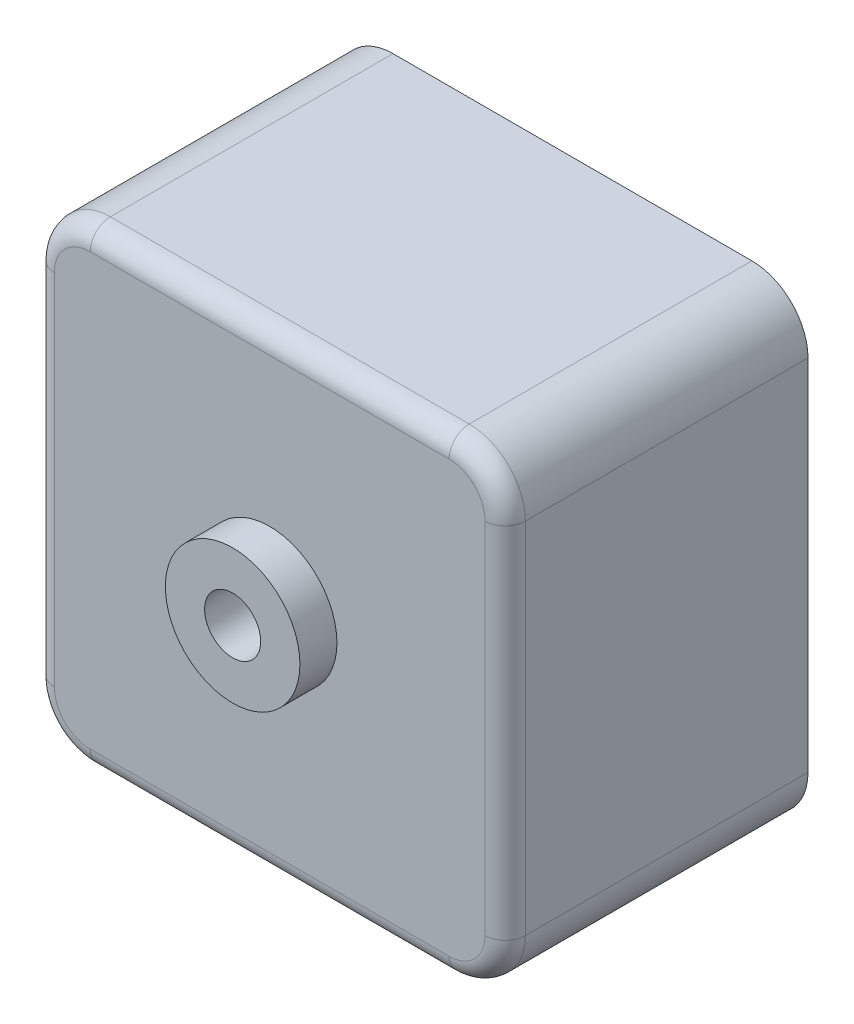
ISO-10303-21;
HEADER;
FILE_DESCRIPTION(('STEP AP214'),'2;1');
FILE_NAME('part.step','',(''),(''),'','','');
FILE_SCHEMA(('AUTOMOTIVE_DESIGN { 1 0 10303 214 1 1 1 1 }'));
ENDSEC;
DATA;
#1=APPLICATION_CONTEXT('core data for automotive mechanical design processes');
#2=APPLICATION_PROTOCOL_DEFINITION('international standard','automotive_design',2000,#1);
#3=PRODUCT_CONTEXT('',#1,'mechanical');
#4=PRODUCT('Part','Part','',(#3));
#5=PRODUCT_RELATED_PRODUCT_CATEGORY('part','',(#4));
#6=PRODUCT_DEFINITION_FORMATION('','',#4);
#7=PRODUCT_DEFINITION_CONTEXT('part definition',#1,'design');
#8=PRODUCT_DEFINITION('design','',#6,#7);
#9=PRODUCT_DEFINITION_SHAPE('','',#8);
#10=(LENGTH_UNIT() NAMED_UNIT(*) SI_UNIT(.MILLI.,.METRE.));
#11=(NAMED_UNIT(*) PLANE_ANGLE_UNIT() SI_UNIT($,.RADIAN.));
#12=(NAMED_UNIT(*) SI_UNIT($,.STERADIAN.) SOLID_ANGLE_UNIT());
#13=UNCERTAINTY_MEASURE_WITH_UNIT(LENGTH_MEASURE(1.E-05),#10,'distance_accuracy_value','');
#14=(GEOMETRIC_REPRESENTATION_CONTEXT(3) GLOBAL_UNCERTAINTY_ASSIGNED_CONTEXT((#13)) GLOBAL_UNIT_ASSIGNED_CONTEXT((#10,
#11,#12)) REPRESENTATION_CONTEXT('',''));
#15=CARTESIAN_POINT('',(0.,0.,0.));
#16=DIRECTION('',(0.,0.,1.));
#17=DIRECTION('',(1.,0.,0.));
#18=AXIS2_PLACEMENT_3D('',#15,#16,#17);
#19=CARTESIAN_POINT('',(42.,0.,0.));
#20=DIRECTION('',(1.,0.,0.));
#21=DIRECTION('',(0.,0.,-1.));
#22=AXIS2_PLACEMENT_3D('',#19,#20,#21);
#23=PLANE('',#22);
#24=DIRECTION('',(0.,0.,1.));
#25=VECTOR('',#24,1.);
#26=CARTESIAN_POINT('',(42.,37.,0.));
#27=LINE('',#26,#25);
#28=CARTESIAN_POINT('',(42.,37.,0.));
#29=VERTEX_POINT('',#28);
#30=CARTESIAN_POINT('',(42.,37.,25.2));
#31=VERTEX_POINT('',#30);
#32=EDGE_CURVE('E245',#29,#31,#27,.T.);
#33=ORIENTED_EDGE('',*,*,#32,.T.);
#34=DIRECTION('',(0.,1.,0.));
#35=VECTOR('',#34,1.);
#36=CARTESIAN_POINT('',(42.,0.,25.2));
#37=LINE('',#36,#35);
#38=CARTESIAN_POINT('',(42.,5.,25.2));
#39=VERTEX_POINT('',#38);
#40=EDGE_CURVE('E193',#31,#39,#37,.F.);
#41=ORIENTED_EDGE('',*,*,#40,.T.);
#42=DIRECTION('',(0.,0.,1.));
#43=VECTOR('',#42,1.);
#44=CARTESIAN_POINT('',(42.,5.,0.));
#45=LINE('',#44,#43);
#46=CARTESIAN_POINT('',(42.,5.,0.));
#47=VERTEX_POINT('',#46);
#48=EDGE_CURVE('E160',#39,#47,#45,.F.);
#49=ORIENTED_EDGE('',*,*,#48,.T.);
#50=DIRECTION('',(0.,1.,0.));
#51=VECTOR('',#50,1.);
#52=CARTESIAN_POINT('',(42.,0.,0.));
#53=LINE('',#52,#51);
#54=EDGE_CURVE('E229',#47,#29,#53,.T.);
#55=ORIENTED_EDGE('',*,*,#54,.T.);
#56=EDGE_LOOP('',(#33,#41,#49,#55));
#57=FACE_BOUND('',#56,.T.);
#58=ADVANCED_FACE('F38',(#57),#23,.T.);
#59=CARTESIAN_POINT('',(0.,0.,0.));
#60=DIRECTION('',(0.,-1.,0.));
#61=DIRECTION('',(0.,0.,-1.));
#62=AXIS2_PLACEMENT_3D('',#59,#60,#61);
#63=PLANE('',#62);
#64=DIRECTION('',(0.,0.,1.));
#65=VECTOR('',#64,1.);
#66=CARTESIAN_POINT('',(37.,0.,0.));
#67=LINE('',#66,#65);
#68=CARTESIAN_POINT('',(37.,0.,0.));
#69=VERTEX_POINT('',#68);
#70=CARTESIAN_POINT('',(37.,0.,25.2));
#71=VERTEX_POINT('',#70);
#72=EDGE_CURVE('E140',#69,#71,#67,.T.);
#73=ORIENTED_EDGE('',*,*,#72,.T.);
#74=DIRECTION('',(1.,0.,0.));
#75=VECTOR('',#74,1.);
#76=CARTESIAN_POINT('',(0.,0.,25.2));
#77=LINE('',#76,#75);
#78=CARTESIAN_POINT('',(5.,0.,25.2));
#79=VERTEX_POINT('',#78);
#80=EDGE_CURVE('E136',#71,#79,#77,.F.);
#81=ORIENTED_EDGE('',*,*,#80,.T.);
#82=DIRECTION('',(0.,0.,1.));
#83=VECTOR('',#82,1.);
#84=CARTESIAN_POINT('',(5.,0.,0.));
#85=LINE('',#84,#83);
#86=CARTESIAN_POINT('',(5.,0.,0.));
#87=VERTEX_POINT('',#86);
#88=EDGE_CURVE('E129',#79,#87,#85,.F.);
#89=ORIENTED_EDGE('',*,*,#88,.T.);
#90=DIRECTION('',(1.,0.,0.));
#91=VECTOR('',#90,1.);
#92=CARTESIAN_POINT('',(0.,0.,0.));
#93=LINE('',#92,#91);
#94=EDGE_CURVE('E133',#87,#69,#93,.T.);
#95=ORIENTED_EDGE('',*,*,#94,.T.);
#96=EDGE_LOOP('',(#73,#81,#89,#95));
#97=FACE_BOUND('',#96,.T.);
#98=ADVANCED_FACE('F132',(#97),#63,.T.);
#99=CARTESIAN_POINT('',(0.,42.,0.));
#100=DIRECTION('',(-1.,0.,0.));
#101=DIRECTION('',(0.,0.,1.));
#102=AXIS2_PLACEMENT_3D('',#99,#100,#101);
#103=PLANE('',#102);
#104=DIRECTION('',(0.,0.,1.));
#105=VECTOR('',#104,1.);
#106=CARTESIAN_POINT('',(0.,5.,0.));
#107=LINE('',#106,#105);
#108=CARTESIAN_POINT('',(0.,5.00000000000001,0.));
#109=VERTEX_POINT('',#108);
#110=CARTESIAN_POINT('',(0.,5.,25.2));
#111=VERTEX_POINT('',#110);
#112=EDGE_CURVE('E155',#109,#111,#107,.T.);
#113=ORIENTED_EDGE('',*,*,#112,.T.);
#114=DIRECTION('',(0.,-1.,0.));
#115=VECTOR('',#114,1.);
#116=CARTESIAN_POINT('',(0.,42.,25.2));
#117=LINE('',#116,#115);
#118=CARTESIAN_POINT('',(0.,37.,25.2));
#119=VERTEX_POINT('',#118);
#120=EDGE_CURVE('E61',#111,#119,#117,.F.);
#121=ORIENTED_EDGE('',*,*,#120,.T.);
#122=DIRECTION('',(0.,0.,1.));
#123=VECTOR('',#122,1.);
#124=CARTESIAN_POINT('',(0.,37.,0.));
#125=LINE('',#124,#123);
#126=CARTESIAN_POINT('',(0.,37.,0.));
#127=VERTEX_POINT('',#126);
#128=EDGE_CURVE('E170',#119,#127,#125,.F.);
#129=ORIENTED_EDGE('',*,*,#128,.T.);
#130=DIRECTION('',(0.,-1.,0.));
#131=VECTOR('',#130,1.);
#132=CARTESIAN_POINT('',(0.,42.,0.));
#133=LINE('',#132,#131);
#134=EDGE_CURVE('E151',#127,#109,#133,.T.);
#135=ORIENTED_EDGE('',*,*,#134,.T.);
#136=EDGE_LOOP('',(#113,#121,#129,#135));
#137=FACE_BOUND('',#136,.T.);
#138=ADVANCED_FACE('F277',(#137),#103,.T.);
#139=CARTESIAN_POINT('',(42.,42.,0.));
#140=DIRECTION('',(0.,1.,0.));
#141=DIRECTION('',(0.,0.,1.));
#142=AXIS2_PLACEMENT_3D('',#139,#140,#141);
#143=PLANE('',#142);
#144=DIRECTION('',(0.,0.,1.));
#145=VECTOR('',#144,1.);
#146=CARTESIAN_POINT('',(5.,42.,0.));
#147=LINE('',#146,#145);
#148=CARTESIAN_POINT('',(5.00000000000001,42.,0.));
#149=VERTEX_POINT('',#148);
#150=CARTESIAN_POINT('',(5.,42.,25.2));
#151=VERTEX_POINT('',#150);
#152=EDGE_CURVE('E167',#149,#151,#147,.T.);
#153=ORIENTED_EDGE('',*,*,#152,.T.);
#154=DIRECTION('',(-1.,0.,0.));
#155=VECTOR('',#154,1.);
#156=CARTESIAN_POINT('',(42.,42.,25.2));
#157=LINE('',#156,#155);
#158=CARTESIAN_POINT('',(37.,42.,25.2));
#159=VERTEX_POINT('',#158);
#160=EDGE_CURVE('E47',#151,#159,#157,.F.);
#161=ORIENTED_EDGE('',*,*,#160,.T.);
#162=DIRECTION('',(0.,0.,1.));
#163=VECTOR('',#162,1.);
#164=CARTESIAN_POINT('',(37.,42.,0.));
#165=LINE('',#164,#163);
#166=CARTESIAN_POINT('',(37.,42.,0.));
#167=VERTEX_POINT('',#166);
#168=EDGE_CURVE('E165',#159,#167,#165,.F.);
#169=ORIENTED_EDGE('',*,*,#168,.T.);
#170=DIRECTION('',(-1.,0.,0.));
#171=VECTOR('',#170,1.);
#172=CARTESIAN_POINT('',(42.,42.,0.));
#173=LINE('',#172,#171);
#174=EDGE_CURVE('E234',#167,#149,#173,.T.);
#175=ORIENTED_EDGE('',*,*,#174,.T.);
#176=EDGE_LOOP('',(#153,#161,#169,#175));
#177=FACE_BOUND('',#176,.T.);
#178=ADVANCED_FACE('F286',(#177),#143,.T.);
#179=CARTESIAN_POINT('',(0.,0.,0.));
#180=DIRECTION('',(0.,0.,1.));
#181=DIRECTION('',(1.,0.,0.));
#182=AXIS2_PLACEMENT_3D('',#179,#180,#181);
#183=PLANE('',#182);
#184=CARTESIAN_POINT('',(21.,21.,0.));
#185=DIRECTION('',(0.,0.,1.));
#186=DIRECTION('',(1.,0.,0.));
#187=AXIS2_PLACEMENT_3D('',#184,#185,#186);
#188=CIRCLE('',#187,2.5);
#189=CARTESIAN_POINT('',(23.5,21.,0.));
#190=VERTEX_POINT('',#189);
#191=EDGE_CURVE('E475',#190,#190,#188,.T.);
#192=ORIENTED_EDGE('',*,*,#191,.T.);
#193=EDGE_LOOP('',(#192));
#194=FACE_BOUND('',#193,.T.);
#195=ORIENTED_EDGE('',*,*,#54,.F.);
#196=CARTESIAN_POINT('',(37.,5.,0.));
#197=DIRECTION('',(0.,0.,1.));
#198=DIRECTION('',(1.,0.,0.));
#199=AXIS2_PLACEMENT_3D('',#196,#197,#198);
#200=CIRCLE('',#199,5.);
#201=EDGE_CURVE('E150',#47,#69,#200,.F.);
#202=ORIENTED_EDGE('',*,*,#201,.T.);
#203=ORIENTED_EDGE('',*,*,#94,.F.);
#204=CARTESIAN_POINT('',(5.,5.,0.));
#205=DIRECTION('',(0.,0.,1.));
#206=DIRECTION('',(1.,0.,0.));
#207=AXIS2_PLACEMENT_3D('',#204,#205,#206);
#208=CIRCLE('',#207,5.);
#209=EDGE_CURVE('E147',#87,#109,#208,.F.);
#210=ORIENTED_EDGE('',*,*,#209,.T.);
#211=ORIENTED_EDGE('',*,*,#134,.F.);
#212=CARTESIAN_POINT('',(5.,37.,0.));
#213=DIRECTION('',(0.,0.,1.));
#214=DIRECTION('',(1.,0.,0.));
#215=AXIS2_PLACEMENT_3D('',#212,#213,#214);
#216=CIRCLE('',#215,5.);
#217=EDGE_CURVE('E156',#127,#149,#216,.F.);
#218=ORIENTED_EDGE('',*,*,#217,.T.);
#219=ORIENTED_EDGE('',*,*,#174,.F.);
#220=CARTESIAN_POINT('',(37.,37.,0.));
#221=DIRECTION('',(0.,0.,1.));
#222=DIRECTION('',(1.,0.,0.));
#223=AXIS2_PLACEMENT_3D('',#220,#221,#222);
#224=CIRCLE('',#223,5.);
#225=EDGE_CURVE('E157',#167,#29,#224,.F.);
#226=ORIENTED_EDGE('',*,*,#225,.T.);
#227=EDGE_LOOP('',(#195,#202,#203,#210,#211,#218,#219,#226));
#228=FACE_BOUND('',#227,.T.);
#229=ADVANCED_FACE('F145',(#194,#228),#183,.F.);
#230=CARTESIAN_POINT('',(0.,0.,27.));
#231=DIRECTION('',(0.,0.,1.));
#232=DIRECTION('',(1.,0.,0.));
#233=AXIS2_PLACEMENT_3D('',#230,#231,#232);
#234=PLANE('',#233);
#235=DIRECTION('',(1.,0.,0.));
#236=VECTOR('',#235,1.);
#237=CARTESIAN_POINT('',(0.,1.8,27.));
#238=LINE('',#237,#236);
#239=CARTESIAN_POINT('',(5.,1.8,27.));
#240=VERTEX_POINT('',#239);
#241=CARTESIAN_POINT('',(37.,1.8,27.));
#242=VERTEX_POINT('',#241);
#243=EDGE_CURVE('E184',#240,#242,#238,.T.);
#244=ORIENTED_EDGE('',*,*,#243,.T.);
#245=CARTESIAN_POINT('',(37.,5.,27.));
#246=DIRECTION('',(0.,0.,1.));
#247=DIRECTION('',(1.,0.,0.));
#248=AXIS2_PLACEMENT_3D('',#245,#246,#247);
#249=CIRCLE('',#248,3.2);
#250=CARTESIAN_POINT('',(40.2,5.,27.));
#251=VERTEX_POINT('',#250);
#252=EDGE_CURVE('E186',#242,#251,#249,.T.);
#253=ORIENTED_EDGE('',*,*,#252,.T.);
#254=DIRECTION('',(0.,1.,0.));
#255=VECTOR('',#254,1.);
#256=CARTESIAN_POINT('',(40.2,0.,27.));
#257=LINE('',#256,#255);
#258=CARTESIAN_POINT('',(40.2,37.,27.));
#259=VERTEX_POINT('',#258);
#260=EDGE_CURVE('E182',#251,#259,#257,.T.);
#261=ORIENTED_EDGE('',*,*,#260,.T.);
#262=CARTESIAN_POINT('',(37.,37.,27.));
#263=DIRECTION('',(0.,0.,1.));
#264=DIRECTION('',(1.,0.,0.));
#265=AXIS2_PLACEMENT_3D('',#262,#263,#264);
#266=CIRCLE('',#265,3.2);
#267=CARTESIAN_POINT('',(37.,40.2,27.));
#268=VERTEX_POINT('',#267);
#269=EDGE_CURVE('E178',#259,#268,#266,.T.);
#270=ORIENTED_EDGE('',*,*,#269,.T.);
#271=DIRECTION('',(-1.,0.,0.));
#272=VECTOR('',#271,1.);
#273=CARTESIAN_POINT('',(0.,40.2,27.));
#274=LINE('',#273,#272);
#275=CARTESIAN_POINT('',(5.,40.2,27.));
#276=VERTEX_POINT('',#275);
#277=EDGE_CURVE('E174',#268,#276,#274,.T.);
#278=ORIENTED_EDGE('',*,*,#277,.T.);
#279=CARTESIAN_POINT('',(5.,37.,27.));
#280=DIRECTION('',(0.,0.,1.));
#281=DIRECTION('',(1.,0.,0.));
#282=AXIS2_PLACEMENT_3D('',#279,#280,#281);
#283=CIRCLE('',#282,3.2);
#284=CARTESIAN_POINT('',(1.8,37.,27.));
#285=VERTEX_POINT('',#284);
#286=EDGE_CURVE('E172',#276,#285,#283,.T.);
#287=ORIENTED_EDGE('',*,*,#286,.T.);
#288=DIRECTION('',(0.,-1.,0.));
#289=VECTOR('',#288,1.);
#290=CARTESIAN_POINT('',(1.8,0.,27.));
#291=LINE('',#290,#289);
#292=CARTESIAN_POINT('',(1.8,5.,27.));
#293=VERTEX_POINT('',#292);
#294=EDGE_CURVE('E176',#285,#293,#291,.T.);
#295=ORIENTED_EDGE('',*,*,#294,.T.);
#296=CARTESIAN_POINT('',(5.,5.,27.));
#297=DIRECTION('',(0.,0.,1.));
#298=DIRECTION('',(1.,0.,0.));
#299=AXIS2_PLACEMENT_3D('',#296,#297,#298);
#300=CIRCLE('',#299,3.2);
#301=EDGE_CURVE('E180',#293,#240,#300,.T.);
#302=ORIENTED_EDGE('',*,*,#301,.T.);
#303=EDGE_LOOP('',(#244,#253,#261,#270,#278,#287,#295,#302));
#304=FACE_BOUND('',#303,.T.);
#305=CARTESIAN_POINT('',(21.,21.,27.));
#306=DIRECTION('',(0.,0.,1.));
#307=DIRECTION('',(1.,0.,0.));
#308=AXIS2_PLACEMENT_3D('',#305,#306,#307);
#309=CIRCLE('',#308,6.);
#310=CARTESIAN_POINT('',(27.,21.,27.));
#311=VERTEX_POINT('',#310);
#312=EDGE_CURVE('E141',#311,#311,#309,.T.);
#313=ORIENTED_EDGE('',*,*,#312,.F.);
#314=EDGE_LOOP('',(#313));
#315=FACE_BOUND('',#314,.T.);
#316=ADVANCED_FACE('F267',(#304,#315),#234,.T.);
#317=CARTESIAN_POINT('',(21.,21.,27.));
#318=DIRECTION('',(0.,0.,1.));
#319=DIRECTION('',(1.,0.,0.));
#320=AXIS2_PLACEMENT_3D('',#317,#318,#319);
#321=CYLINDRICAL_SURFACE('',#320,6.);
#322=ORIENTED_EDGE('',*,*,#312,.T.);
#323=EDGE_LOOP('',(#322));
#324=FACE_BOUND('',#323,.T.);
#325=CARTESIAN_POINT('',(21.,21.,30.3));
#326=DIRECTION('',(0.,0.,1.));
#327=DIRECTION('',(1.,0.,0.));
#328=AXIS2_PLACEMENT_3D('',#325,#326,#327);
#329=CIRCLE('',#328,6.);
#330=CARTESIAN_POINT('',(27.,21.,30.3));
#331=VERTEX_POINT('',#330);
#332=EDGE_CURVE('E224',#331,#331,#329,.T.);
#333=ORIENTED_EDGE('',*,*,#332,.F.);
#334=EDGE_LOOP('',(#333));
#335=FACE_BOUND('',#334,.T.);
#336=ADVANCED_FACE('F360',(#324,#335),#321,.T.);
#337=CARTESIAN_POINT('',(23.5,21.,30.3));
#338=DIRECTION('',(0.,0.,1.));
#339=DIRECTION('',(1.,0.,0.));
#340=AXIS2_PLACEMENT_3D('',#337,#338,#339);
#341=PLANE('',#340);
#342=ORIENTED_EDGE('',*,*,#332,.T.);
#343=EDGE_LOOP('',(#342));
#344=FACE_BOUND('',#343,.T.);
#345=CARTESIAN_POINT('',(21.,21.,30.3));
#346=DIRECTION('',(0.,0.,1.));
#347=DIRECTION('',(1.,0.,0.));
#348=AXIS2_PLACEMENT_3D('',#345,#346,#347);
#349=CIRCLE('',#348,2.5);
#350=CARTESIAN_POINT('',(23.5,21.,30.3));
#351=VERTEX_POINT('',#350);
#352=EDGE_CURVE('E204',#351,#351,#349,.T.);
#353=ORIENTED_EDGE('',*,*,#352,.F.);
#354=EDGE_LOOP('',(#353));
#355=FACE_BOUND('',#354,.T.);
#356=ADVANCED_FACE('F311',(#344,#355),#341,.T.);
#357=CARTESIAN_POINT('',(37.,5.,0.));
#358=DIRECTION('',(0.,0.,1.));
#359=DIRECTION('',(1.,0.,0.));
#360=AXIS2_PLACEMENT_3D('',#357,#358,#359);
#361=CYLINDRICAL_SURFACE('',#360,5.);
#362=ORIENTED_EDGE('',*,*,#48,.F.);
#363=CARTESIAN_POINT('',(37.,5.,25.2));
#364=DIRECTION('',(0.,0.,1.));
#365=DIRECTION('',(1.,0.,0.));
#366=AXIS2_PLACEMENT_3D('',#363,#364,#365);
#367=CIRCLE('',#366,5.);
#368=EDGE_CURVE('E189',#39,#71,#367,.F.);
#369=ORIENTED_EDGE('',*,*,#368,.T.);
#370=ORIENTED_EDGE('',*,*,#72,.F.);
#371=ORIENTED_EDGE('',*,*,#201,.F.);
#372=EDGE_LOOP('',(#362,#369,#370,#371));
#373=FACE_BOUND('',#372,.T.);
#374=ADVANCED_FACE('F255',(#373),#361,.T.);
#375=CARTESIAN_POINT('',(5.,37.,0.));
#376=DIRECTION('',(0.,0.,1.));
#377=DIRECTION('',(1.,0.,0.));
#378=AXIS2_PLACEMENT_3D('',#375,#376,#377);
#379=CYLINDRICAL_SURFACE('',#378,5.);
#380=ORIENTED_EDGE('',*,*,#128,.F.);
#381=CARTESIAN_POINT('',(5.,37.,25.2));
#382=DIRECTION('',(0.,0.,1.));
#383=DIRECTION('',(1.,0.,0.));
#384=AXIS2_PLACEMENT_3D('',#381,#382,#383);
#385=CIRCLE('',#384,5.);
#386=EDGE_CURVE('E11',#119,#151,#385,.F.);
#387=ORIENTED_EDGE('',*,*,#386,.T.);
#388=ORIENTED_EDGE('',*,*,#152,.F.);
#389=ORIENTED_EDGE('',*,*,#217,.F.);
#390=EDGE_LOOP('',(#380,#387,#388,#389));
#391=FACE_BOUND('',#390,.T.);
#392=ADVANCED_FACE('F310',(#391),#379,.T.);
#393=CARTESIAN_POINT('',(5.,5.,0.));
#394=DIRECTION('',(0.,0.,1.));
#395=DIRECTION('',(1.,0.,0.));
#396=AXIS2_PLACEMENT_3D('',#393,#394,#395);
#397=CYLINDRICAL_SURFACE('',#396,5.);
#398=ORIENTED_EDGE('',*,*,#88,.F.);
#399=CARTESIAN_POINT('',(5.,5.,25.2));
#400=DIRECTION('',(0.,0.,1.));
#401=DIRECTION('',(1.,0.,0.));
#402=AXIS2_PLACEMENT_3D('',#399,#400,#401);
#403=CIRCLE('',#402,5.);
#404=EDGE_CURVE('E195',#79,#111,#403,.F.);
#405=ORIENTED_EDGE('',*,*,#404,.T.);
#406=ORIENTED_EDGE('',*,*,#112,.F.);
#407=ORIENTED_EDGE('',*,*,#209,.F.);
#408=EDGE_LOOP('',(#398,#405,#406,#407));
#409=FACE_BOUND('',#408,.T.);
#410=ADVANCED_FACE('F154',(#409),#397,.T.);
#411=CARTESIAN_POINT('',(37.,37.,0.));
#412=DIRECTION('',(0.,0.,1.));
#413=DIRECTION('',(1.,0.,0.));
#414=AXIS2_PLACEMENT_3D('',#411,#412,#413);
#415=CYLINDRICAL_SURFACE('',#414,5.);
#416=ORIENTED_EDGE('',*,*,#168,.F.);
#417=CARTESIAN_POINT('',(37.,37.,25.2));
#418=DIRECTION('',(0.,0.,1.));
#419=DIRECTION('',(1.,0.,0.));
#420=AXIS2_PLACEMENT_3D('',#417,#418,#419);
#421=CIRCLE('',#420,5.);
#422=EDGE_CURVE('E197',#159,#31,#421,.F.);
#423=ORIENTED_EDGE('',*,*,#422,.T.);
#424=ORIENTED_EDGE('',*,*,#32,.F.);
#425=ORIENTED_EDGE('',*,*,#225,.F.);
#426=EDGE_LOOP('',(#416,#423,#424,#425));
#427=FACE_BOUND('',#426,.T.);
#428=ADVANCED_FACE('F288',(#427),#415,.T.);
#429=CARTESIAN_POINT('',(5.,37.,25.2));
#430=DIRECTION('',(0.,0.,1.));
#431=DIRECTION('',(1.,0.,0.));
#432=AXIS2_PLACEMENT_3D('',#429,#430,#431);
#433=TOROIDAL_SURFACE('',#432,3.2,1.8);
#434=CARTESIAN_POINT('',(5.,40.2,25.2));
#435=DIRECTION('',(1.,0.,0.));
#436=DIRECTION('',(0.,0.,-1.));
#437=AXIS2_PLACEMENT_3D('',#434,#435,#436);
#438=CIRCLE('',#437,1.8);
#439=EDGE_CURVE('E217',#151,#276,#438,.T.);
#440=ORIENTED_EDGE('',*,*,#439,.F.);
#441=ORIENTED_EDGE('',*,*,#386,.F.);
#442=CARTESIAN_POINT('',(1.8,37.,25.2));
#443=DIRECTION('',(0.,-1.,0.));
#444=DIRECTION('',(0.,0.,-1.));
#445=AXIS2_PLACEMENT_3D('',#442,#443,#444);
#446=CIRCLE('',#445,1.8);
#447=EDGE_CURVE('E42',#285,#119,#446,.T.);
#448=ORIENTED_EDGE('',*,*,#447,.F.);
#449=ORIENTED_EDGE('',*,*,#286,.F.);
#450=EDGE_LOOP('',(#440,#441,#448,#449));
#451=FACE_BOUND('',#450,.T.);
#452=ADVANCED_FACE('F40',(#451),#433,.T.);
#453=CARTESIAN_POINT('',(1.8,0.,25.2));
#454=DIRECTION('',(0.,-1.,0.));
#455=DIRECTION('',(0.,0.,-1.));
#456=AXIS2_PLACEMENT_3D('',#453,#454,#455);
#457=CYLINDRICAL_SURFACE('',#456,1.8);
#458=ORIENTED_EDGE('',*,*,#447,.T.);
#459=ORIENTED_EDGE('',*,*,#120,.F.);
#460=CARTESIAN_POINT('',(1.8,5.,25.2));
#461=DIRECTION('',(0.,-1.,0.));
#462=DIRECTION('',(0.,0.,-1.));
#463=AXIS2_PLACEMENT_3D('',#460,#461,#462);
#464=CIRCLE('',#463,1.8);
#465=EDGE_CURVE('E215',#293,#111,#464,.T.);
#466=ORIENTED_EDGE('',*,*,#465,.F.);
#467=ORIENTED_EDGE('',*,*,#294,.F.);
#468=EDGE_LOOP('',(#458,#459,#466,#467));
#469=FACE_BOUND('',#468,.T.);
#470=ADVANCED_FACE('F278',(#469),#457,.T.);
#471=CARTESIAN_POINT('',(0.,40.2,25.2));
#472=DIRECTION('',(-1.,0.,0.));
#473=DIRECTION('',(0.,0.,1.));
#474=AXIS2_PLACEMENT_3D('',#471,#472,#473);
#475=CYLINDRICAL_SURFACE('',#474,1.8);
#476=ORIENTED_EDGE('',*,*,#439,.T.);
#477=ORIENTED_EDGE('',*,*,#277,.F.);
#478=CARTESIAN_POINT('',(37.,40.2,25.2));
#479=DIRECTION('',(1.,0.,0.));
#480=DIRECTION('',(0.,0.,-1.));
#481=AXIS2_PLACEMENT_3D('',#478,#479,#480);
#482=CIRCLE('',#481,1.8);
#483=EDGE_CURVE('E212',#159,#268,#482,.T.);
#484=ORIENTED_EDGE('',*,*,#483,.F.);
#485=ORIENTED_EDGE('',*,*,#160,.F.);
#486=EDGE_LOOP('',(#476,#477,#484,#485));
#487=FACE_BOUND('',#486,.T.);
#488=ADVANCED_FACE('F282',(#487),#475,.T.);
#489=CARTESIAN_POINT('',(5.,5.,25.2));
#490=DIRECTION('',(0.,0.,1.));
#491=DIRECTION('',(1.,0.,0.));
#492=AXIS2_PLACEMENT_3D('',#489,#490,#491);
#493=TOROIDAL_SURFACE('',#492,3.2,1.8);
#494=ORIENTED_EDGE('',*,*,#465,.T.);
#495=ORIENTED_EDGE('',*,*,#404,.F.);
#496=CARTESIAN_POINT('',(5.,1.8,25.2));
#497=DIRECTION('',(1.,0.,0.));
#498=DIRECTION('',(0.,0.,-1.));
#499=AXIS2_PLACEMENT_3D('',#496,#497,#498);
#500=CIRCLE('',#499,1.8);
#501=EDGE_CURVE('E209',#240,#79,#500,.T.);
#502=ORIENTED_EDGE('',*,*,#501,.F.);
#503=ORIENTED_EDGE('',*,*,#301,.F.);
#504=EDGE_LOOP('',(#494,#495,#502,#503));
#505=FACE_BOUND('',#504,.T.);
#506=ADVANCED_FACE('F275',(#505),#493,.T.);
#507=CARTESIAN_POINT('',(37.,37.,25.2));
#508=DIRECTION('',(0.,0.,1.));
#509=DIRECTION('',(1.,0.,0.));
#510=AXIS2_PLACEMENT_3D('',#507,#508,#509);
#511=TOROIDAL_SURFACE('',#510,3.2,1.8);
#512=ORIENTED_EDGE('',*,*,#483,.T.);
#513=ORIENTED_EDGE('',*,*,#269,.F.);
#514=CARTESIAN_POINT('',(40.2,37.,25.2));
#515=DIRECTION('',(0.,-1.,0.));
#516=DIRECTION('',(0.,0.,-1.));
#517=AXIS2_PLACEMENT_3D('',#514,#515,#516);
#518=CIRCLE('',#517,1.8);
#519=EDGE_CURVE('E206',#31,#259,#518,.T.);
#520=ORIENTED_EDGE('',*,*,#519,.F.);
#521=ORIENTED_EDGE('',*,*,#422,.F.);
#522=EDGE_LOOP('',(#512,#513,#520,#521));
#523=FACE_BOUND('',#522,.T.);
#524=ADVANCED_FACE('F290',(#523),#511,.T.);
#525=CARTESIAN_POINT('',(0.,1.8,25.2));
#526=DIRECTION('',(1.,0.,0.));
#527=DIRECTION('',(0.,0.,-1.));
#528=AXIS2_PLACEMENT_3D('',#525,#526,#527);
#529=CYLINDRICAL_SURFACE('',#528,1.8);
#530=ORIENTED_EDGE('',*,*,#501,.T.);
#531=ORIENTED_EDGE('',*,*,#80,.F.);
#532=CARTESIAN_POINT('',(37.,1.8,25.2));
#533=DIRECTION('',(1.,0.,0.));
#534=DIRECTION('',(0.,0.,-1.));
#535=AXIS2_PLACEMENT_3D('',#532,#533,#534);
#536=CIRCLE('',#535,1.8);
#537=EDGE_CURVE('E203',#242,#71,#536,.T.);
#538=ORIENTED_EDGE('',*,*,#537,.F.);
#539=ORIENTED_EDGE('',*,*,#243,.F.);
#540=EDGE_LOOP('',(#530,#531,#538,#539));
#541=FACE_BOUND('',#540,.T.);
#542=ADVANCED_FACE('F273',(#541),#529,.T.);
#543=CARTESIAN_POINT('',(40.2,0.,25.2));
#544=DIRECTION('',(0.,1.,0.));
#545=DIRECTION('',(0.,0.,1.));
#546=AXIS2_PLACEMENT_3D('',#543,#544,#545);
#547=CYLINDRICAL_SURFACE('',#546,1.8);
#548=ORIENTED_EDGE('',*,*,#519,.T.);
#549=ORIENTED_EDGE('',*,*,#260,.F.);
#550=CARTESIAN_POINT('',(40.2,5.,25.2));
#551=DIRECTION('',(0.,-1.,0.));
#552=DIRECTION('',(0.,0.,-1.));
#553=AXIS2_PLACEMENT_3D('',#550,#551,#552);
#554=CIRCLE('',#553,1.8);
#555=EDGE_CURVE('E201',#39,#251,#554,.T.);
#556=ORIENTED_EDGE('',*,*,#555,.F.);
#557=ORIENTED_EDGE('',*,*,#40,.F.);
#558=EDGE_LOOP('',(#548,#549,#556,#557));
#559=FACE_BOUND('',#558,.T.);
#560=ADVANCED_FACE('F263',(#559),#547,.T.);
#561=CARTESIAN_POINT('',(37.,5.,25.2));
#562=DIRECTION('',(0.,0.,1.));
#563=DIRECTION('',(1.,0.,0.));
#564=AXIS2_PLACEMENT_3D('',#561,#562,#563);
#565=TOROIDAL_SURFACE('',#564,3.2,1.8);
#566=ORIENTED_EDGE('',*,*,#537,.T.);
#567=ORIENTED_EDGE('',*,*,#368,.F.);
#568=ORIENTED_EDGE('',*,*,#555,.T.);
#569=ORIENTED_EDGE('',*,*,#252,.F.);
#570=EDGE_LOOP('',(#566,#567,#568,#569));
#571=FACE_BOUND('',#570,.T.);
#572=ADVANCED_FACE('F258',(#571),#565,.T.);
#573=CARTESIAN_POINT('',(21.,21.,0.));
#574=DIRECTION('',(0.,0.,1.));
#575=DIRECTION('',(1.,0.,0.));
#576=AXIS2_PLACEMENT_3D('',#573,#574,#575);
#577=CYLINDRICAL_SURFACE('',#576,2.5);
#578=ORIENTED_EDGE('',*,*,#352,.T.);
#579=EDGE_LOOP('',(#578));
#580=FACE_BOUND('',#579,.T.);
#581=ORIENTED_EDGE('',*,*,#191,.F.);
#582=EDGE_LOOP('',(#581));
#583=FACE_BOUND('',#582,.T.);
#584=ADVANCED_FACE('F320',(#580,#583),#577,.F.);
#585=CLOSED_SHELL('',(#58,#98,#138,#178,#229,#316,#336,#356,#374,#392,#410,#428,#452,#470,#488,
#506,#524,#542,#560,#572,#584));
#586=MANIFOLD_SOLID_BREP('B2',#585);
#587=ADVANCED_BREP_SHAPE_REPRESENTATION('',(#18,#586),#14);
#588=SHAPE_DEFINITION_REPRESENTATION(#9,#587);
ENDSEC;
END-ISO-10303-21;
